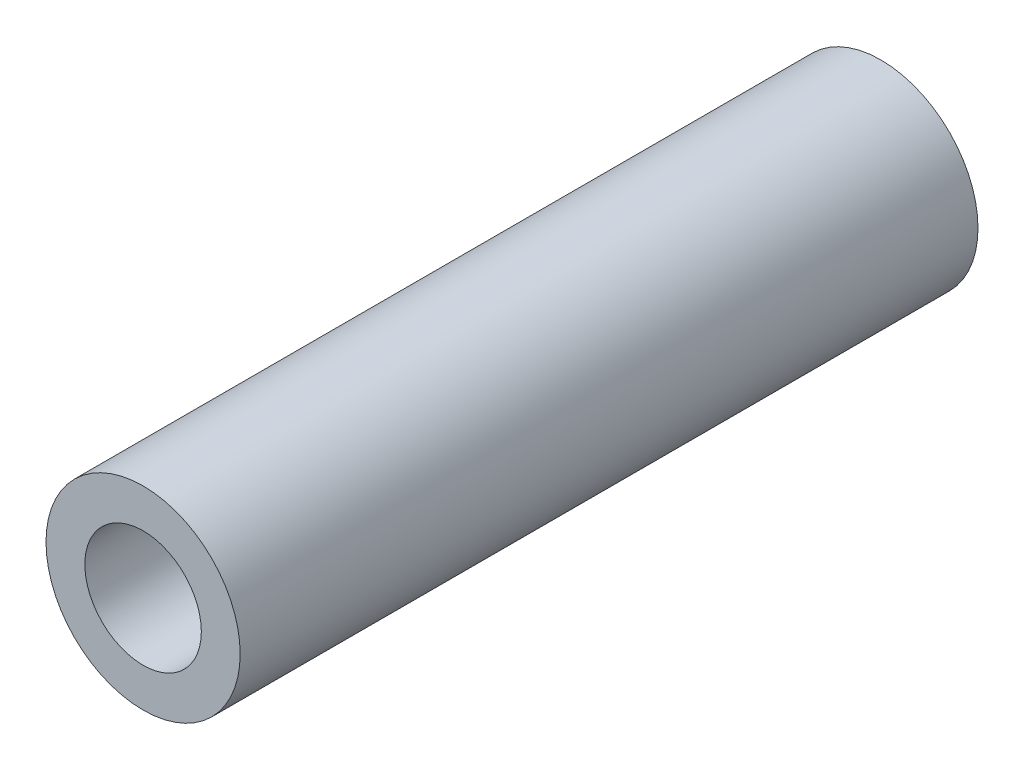
ISO-10303-21;
HEADER;
FILE_DESCRIPTION(('STEP AP214'),'2;1');
FILE_NAME('part.step','',(''),(''),'','','');
FILE_SCHEMA(('AUTOMOTIVE_DESIGN { 1 0 10303 214 1 1 1 1 }'));
ENDSEC;
DATA;
#1=APPLICATION_CONTEXT('core data for automotive mechanical design processes');
#2=APPLICATION_PROTOCOL_DEFINITION('international standard','automotive_design',2000,#1);
#3=PRODUCT_CONTEXT('',#1,'mechanical');
#4=PRODUCT('Part','Part','',(#3));
#5=PRODUCT_RELATED_PRODUCT_CATEGORY('part','',(#4));
#6=PRODUCT_DEFINITION_FORMATION('','',#4);
#7=PRODUCT_DEFINITION_CONTEXT('part definition',#1,'design');
#8=PRODUCT_DEFINITION('design','',#6,#7);
#9=PRODUCT_DEFINITION_SHAPE('','',#8);
#10=(LENGTH_UNIT() NAMED_UNIT(*) SI_UNIT(.MILLI.,.METRE.));
#11=(NAMED_UNIT(*) PLANE_ANGLE_UNIT() SI_UNIT($,.RADIAN.));
#12=(NAMED_UNIT(*) SI_UNIT($,.STERADIAN.) SOLID_ANGLE_UNIT());
#13=UNCERTAINTY_MEASURE_WITH_UNIT(LENGTH_MEASURE(1.E-05),#10,'distance_accuracy_value','');
#14=(GEOMETRIC_REPRESENTATION_CONTEXT(3) GLOBAL_UNCERTAINTY_ASSIGNED_CONTEXT((#13)) GLOBAL_UNIT_ASSIGNED_CONTEXT((#10,
#11,#12)) REPRESENTATION_CONTEXT('',''));
#15=CARTESIAN_POINT('',(0.,0.,0.));
#16=DIRECTION('',(0.,0.,1.));
#17=DIRECTION('',(1.,0.,0.));
#18=AXIS2_PLACEMENT_3D('',#15,#16,#17);
#19=CARTESIAN_POINT('',(0.,0.,38.));
#20=DIRECTION('',(0.,0.,1.));
#21=DIRECTION('',(1.,0.,0.));
#22=AXIS2_PLACEMENT_3D('',#19,#20,#21);
#23=PLANE('',#22);
#24=CARTESIAN_POINT('',(0.,0.,38.));
#25=DIRECTION('',(0.,0.,1.));
#26=DIRECTION('',(1.,0.,0.));
#27=AXIS2_PLACEMENT_3D('',#24,#25,#26);
#28=CIRCLE('',#27,5.);
#29=CARTESIAN_POINT('',(5.,0.,38.));
#30=VERTEX_POINT('',#29);
#31=EDGE_CURVE('E10',#30,#30,#28,.T.);
#32=ORIENTED_EDGE('',*,*,#31,.T.);
#33=EDGE_LOOP('',(#32));
#34=FACE_BOUND('',#33,.T.);
#35=CARTESIAN_POINT('',(0.,0.,38.));
#36=DIRECTION('',(0.,0.,1.));
#37=DIRECTION('',(1.,0.,0.));
#38=AXIS2_PLACEMENT_3D('',#35,#36,#37);
#39=CIRCLE('',#38,3.);
#40=CARTESIAN_POINT('',(3.,0.,38.));
#41=VERTEX_POINT('',#40);
#42=EDGE_CURVE('E44',#41,#41,#39,.T.);
#43=ORIENTED_EDGE('',*,*,#42,.F.);
#44=EDGE_LOOP('',(#43));
#45=FACE_BOUND('',#44,.T.);
#46=ADVANCED_FACE('F33',(#34,#45),#23,.T.);
#47=CARTESIAN_POINT('',(0.,0.,0.));
#48=DIRECTION('',(0.,0.,1.));
#49=DIRECTION('',(1.,0.,0.));
#50=AXIS2_PLACEMENT_3D('',#47,#48,#49);
#51=PLANE('',#50);
#52=CARTESIAN_POINT('',(0.,0.,0.));
#53=DIRECTION('',(0.,0.,1.));
#54=DIRECTION('',(1.,0.,0.));
#55=AXIS2_PLACEMENT_3D('',#52,#53,#54);
#56=CIRCLE('',#55,5.);
#57=CARTESIAN_POINT('',(5.,0.,0.));
#58=VERTEX_POINT('',#57);
#59=EDGE_CURVE('E37',#58,#58,#56,.T.);
#60=ORIENTED_EDGE('',*,*,#59,.F.);
#61=EDGE_LOOP('',(#60));
#62=FACE_BOUND('',#61,.T.);
#63=CARTESIAN_POINT('',(0.,0.,0.));
#64=DIRECTION('',(0.,0.,1.));
#65=DIRECTION('',(1.,0.,0.));
#66=AXIS2_PLACEMENT_3D('',#63,#64,#65);
#67=CIRCLE('',#66,3.);
#68=CARTESIAN_POINT('',(3.,0.,0.));
#69=VERTEX_POINT('',#68);
#70=EDGE_CURVE('E46',#69,#69,#67,.T.);
#71=ORIENTED_EDGE('',*,*,#70,.T.);
#72=EDGE_LOOP('',(#71));
#73=FACE_BOUND('',#72,.T.);
#74=ADVANCED_FACE('F56',(#62,#73),#51,.F.);
#75=CARTESIAN_POINT('',(0.,0.,38.));
#76=DIRECTION('',(0.,0.,-1.));
#77=DIRECTION('',(-1.,0.,0.));
#78=AXIS2_PLACEMENT_3D('',#75,#76,#77);
#79=CYLINDRICAL_SURFACE('',#78,5.);
#80=ORIENTED_EDGE('',*,*,#31,.F.);
#81=EDGE_LOOP('',(#80));
#82=FACE_BOUND('',#81,.T.);
#83=ORIENTED_EDGE('',*,*,#59,.T.);
#84=EDGE_LOOP('',(#83));
#85=FACE_BOUND('',#84,.T.);
#86=ADVANCED_FACE('F35',(#82,#85),#79,.T.);
#87=CARTESIAN_POINT('',(0.,0.,38.));
#88=DIRECTION('',(0.,0.,-1.));
#89=DIRECTION('',(-1.,0.,0.));
#90=AXIS2_PLACEMENT_3D('',#87,#88,#89);
#91=CYLINDRICAL_SURFACE('',#90,3.);
#92=ORIENTED_EDGE('',*,*,#42,.T.);
#93=EDGE_LOOP('',(#92));
#94=FACE_BOUND('',#93,.T.);
#95=ORIENTED_EDGE('',*,*,#70,.F.);
#96=EDGE_LOOP('',(#95));
#97=FACE_BOUND('',#96,.T.);
#98=ADVANCED_FACE('F52',(#94,#97),#91,.F.);
#99=CLOSED_SHELL('',(#46,#74,#86,#98));
#100=MANIFOLD_SOLID_BREP('B2',#99);
#101=ADVANCED_BREP_SHAPE_REPRESENTATION('',(#18,#100),#14);
#102=SHAPE_DEFINITION_REPRESENTATION(#9,#101);
ENDSEC;
END-ISO-10303-21;
